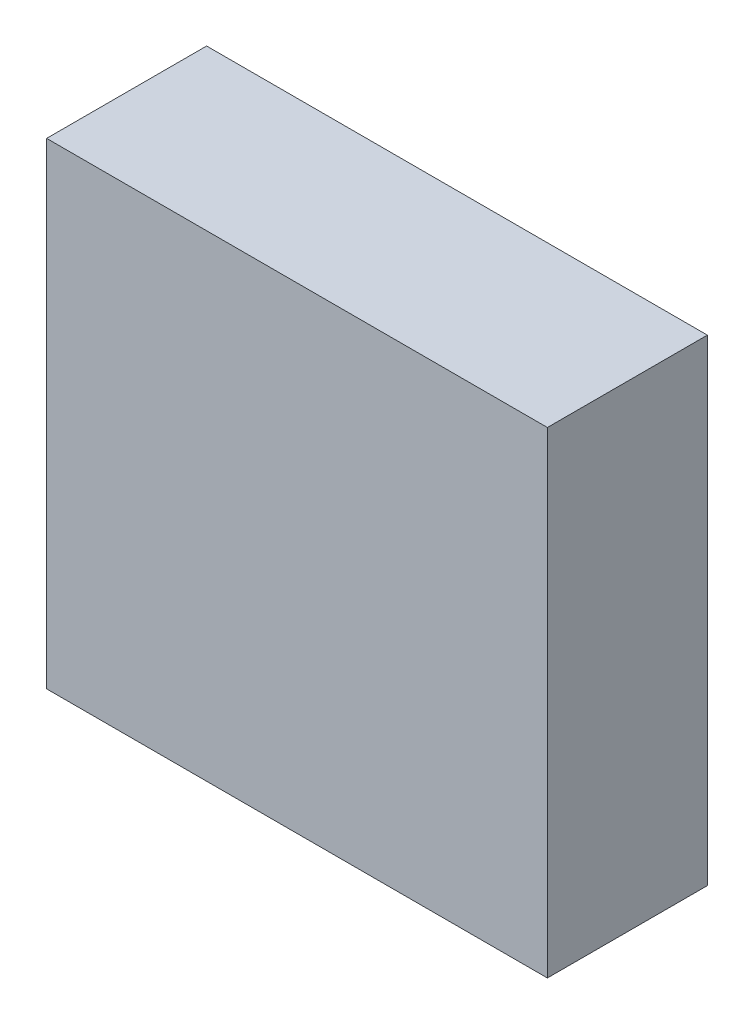
ISO-10303-21;
HEADER;
FILE_DESCRIPTION(('STEP AP214'),'2;1');
FILE_NAME('part.step','',(''),(''),'','','');
FILE_SCHEMA(('AUTOMOTIVE_DESIGN { 1 0 10303 214 1 1 1 1 }'));
ENDSEC;
DATA;
#1=APPLICATION_CONTEXT('core data for automotive mechanical design processes');
#2=APPLICATION_PROTOCOL_DEFINITION('international standard','automotive_design',2000,#1);
#3=PRODUCT_CONTEXT('',#1,'mechanical');
#4=PRODUCT('Part','Part','',(#3));
#5=PRODUCT_RELATED_PRODUCT_CATEGORY('part','',(#4));
#6=PRODUCT_DEFINITION_FORMATION('','',#4);
#7=PRODUCT_DEFINITION_CONTEXT('part definition',#1,'design');
#8=PRODUCT_DEFINITION('design','',#6,#7);
#9=PRODUCT_DEFINITION_SHAPE('','',#8);
#10=(LENGTH_UNIT() NAMED_UNIT(*) SI_UNIT(.MILLI.,.METRE.));
#11=(NAMED_UNIT(*) PLANE_ANGLE_UNIT() SI_UNIT($,.RADIAN.));
#12=(NAMED_UNIT(*) SI_UNIT($,.STERADIAN.) SOLID_ANGLE_UNIT());
#13=UNCERTAINTY_MEASURE_WITH_UNIT(LENGTH_MEASURE(1.E-05),#10,'distance_accuracy_value','');
#14=(GEOMETRIC_REPRESENTATION_CONTEXT(3) GLOBAL_UNCERTAINTY_ASSIGNED_CONTEXT((#13)) GLOBAL_UNIT_ASSIGNED_CONTEXT((#10,
#11,#12)) REPRESENTATION_CONTEXT('',''));
#15=CARTESIAN_POINT('',(0.,0.,0.));
#16=DIRECTION('',(0.,0.,1.));
#17=DIRECTION('',(1.,0.,0.));
#18=AXIS2_PLACEMENT_3D('',#15,#16,#17);
#19=CARTESIAN_POINT('',(39.751,37.846,25.4));
#20=DIRECTION('',(-1.,0.,0.));
#21=DIRECTION('',(0.,-1.,0.));
#22=AXIS2_PLACEMENT_3D('',#19,#20,#21);
#23=PLANE('',#22);
#24=DIRECTION('',(0.,1.,0.));
#25=VECTOR('',#24,1.);
#26=CARTESIAN_POINT('',(39.751,37.846,0.));
#27=LINE('',#26,#25);
#28=CARTESIAN_POINT('',(39.751,-37.846,0.));
#29=VERTEX_POINT('',#28);
#30=CARTESIAN_POINT('',(39.751,37.846,0.));
#31=VERTEX_POINT('',#30);
#32=EDGE_CURVE('E106',#29,#31,#27,.T.);
#33=ORIENTED_EDGE('',*,*,#32,.T.);
#34=DIRECTION('',(0.,0.,-1.));
#35=VECTOR('',#34,1.);
#36=CARTESIAN_POINT('',(39.751,37.846,25.4));
#37=LINE('',#36,#35);
#38=CARTESIAN_POINT('',(39.751,37.846,25.4));
#39=VERTEX_POINT('',#38);
#40=EDGE_CURVE('E11',#39,#31,#37,.T.);
#41=ORIENTED_EDGE('',*,*,#40,.F.);
#42=DIRECTION('',(0.,1.,0.));
#43=VECTOR('',#42,1.);
#44=CARTESIAN_POINT('',(39.751,37.846,25.4));
#45=LINE('',#44,#43);
#46=CARTESIAN_POINT('',(39.751,-37.846,25.4));
#47=VERTEX_POINT('',#46);
#48=EDGE_CURVE('E94',#47,#39,#45,.T.);
#49=ORIENTED_EDGE('',*,*,#48,.F.);
#50=DIRECTION('',(0.,0.,-1.));
#51=VECTOR('',#50,1.);
#52=CARTESIAN_POINT('',(39.751,-37.846,25.4));
#53=LINE('',#52,#51);
#54=EDGE_CURVE('E102',#47,#29,#53,.T.);
#55=ORIENTED_EDGE('',*,*,#54,.T.);
#56=EDGE_LOOP('',(#33,#41,#49,#55));
#57=FACE_BOUND('',#56,.T.);
#58=ADVANCED_FACE('F43',(#57),#23,.F.);
#59=CARTESIAN_POINT('',(-39.751,37.846,25.4));
#60=DIRECTION('',(0.,-1.,0.));
#61=DIRECTION('',(0.,0.,-1.));
#62=AXIS2_PLACEMENT_3D('',#59,#60,#61);
#63=PLANE('',#62);
#64=DIRECTION('',(-1.,0.,0.));
#65=VECTOR('',#64,1.);
#66=CARTESIAN_POINT('',(-39.751,37.846,0.));
#67=LINE('',#66,#65);
#68=CARTESIAN_POINT('',(-39.751,37.846,0.));
#69=VERTEX_POINT('',#68);
#70=EDGE_CURVE('E98',#31,#69,#67,.T.);
#71=ORIENTED_EDGE('',*,*,#70,.T.);
#72=DIRECTION('',(0.,0.,-1.));
#73=VECTOR('',#72,1.);
#74=CARTESIAN_POINT('',(-39.751,37.846,25.4));
#75=LINE('',#74,#73);
#76=CARTESIAN_POINT('',(-39.751,37.846,25.4));
#77=VERTEX_POINT('',#76);
#78=EDGE_CURVE('E51',#77,#69,#75,.T.);
#79=ORIENTED_EDGE('',*,*,#78,.F.);
#80=DIRECTION('',(-1.,0.,0.));
#81=VECTOR('',#80,1.);
#82=CARTESIAN_POINT('',(-39.751,37.846,25.4));
#83=LINE('',#82,#81);
#84=EDGE_CURVE('E89',#39,#77,#83,.T.);
#85=ORIENTED_EDGE('',*,*,#84,.F.);
#86=ORIENTED_EDGE('',*,*,#40,.T.);
#87=EDGE_LOOP('',(#71,#79,#85,#86));
#88=FACE_BOUND('',#87,.T.);
#89=ADVANCED_FACE('F97',(#88),#63,.F.);
#90=CARTESIAN_POINT('',(-39.751,37.846,25.4));
#91=DIRECTION('',(1.,0.,0.));
#92=DIRECTION('',(0.,1.,0.));
#93=AXIS2_PLACEMENT_3D('',#90,#91,#92);
#94=PLANE('',#93);
#95=DIRECTION('',(0.,-1.,0.));
#96=VECTOR('',#95,1.);
#97=CARTESIAN_POINT('',(-39.751,37.846,0.));
#98=LINE('',#97,#96);
#99=CARTESIAN_POINT('',(-39.751,-37.846,0.));
#100=VERTEX_POINT('',#99);
#101=EDGE_CURVE('E76',#69,#100,#98,.T.);
#102=ORIENTED_EDGE('',*,*,#101,.T.);
#103=DIRECTION('',(0.,0.,-1.));
#104=VECTOR('',#103,1.);
#105=CARTESIAN_POINT('',(-39.751,-37.846,25.4));
#106=LINE('',#105,#104);
#107=CARTESIAN_POINT('',(-39.751,-37.846,25.4));
#108=VERTEX_POINT('',#107);
#109=EDGE_CURVE('E99',#108,#100,#106,.T.);
#110=ORIENTED_EDGE('',*,*,#109,.F.);
#111=DIRECTION('',(0.,-1.,0.));
#112=VECTOR('',#111,1.);
#113=CARTESIAN_POINT('',(-39.751,37.846,25.4));
#114=LINE('',#113,#112);
#115=EDGE_CURVE('E92',#77,#108,#114,.T.);
#116=ORIENTED_EDGE('',*,*,#115,.F.);
#117=ORIENTED_EDGE('',*,*,#78,.T.);
#118=EDGE_LOOP('',(#102,#110,#116,#117));
#119=FACE_BOUND('',#118,.T.);
#120=ADVANCED_FACE('F100',(#119),#94,.F.);
#121=CARTESIAN_POINT('',(-39.751,-37.846,25.4));
#122=DIRECTION('',(0.,1.,0.));
#123=DIRECTION('',(0.,0.,1.));
#124=AXIS2_PLACEMENT_3D('',#121,#122,#123);
#125=PLANE('',#124);
#126=DIRECTION('',(1.,0.,0.));
#127=VECTOR('',#126,1.);
#128=CARTESIAN_POINT('',(-39.751,-37.846,0.));
#129=LINE('',#128,#127);
#130=EDGE_CURVE('E82',#100,#29,#129,.T.);
#131=ORIENTED_EDGE('',*,*,#130,.T.);
#132=ORIENTED_EDGE('',*,*,#54,.F.);
#133=DIRECTION('',(1.,0.,0.));
#134=VECTOR('',#133,1.);
#135=CARTESIAN_POINT('',(-39.751,-37.846,25.4));
#136=LINE('',#135,#134);
#137=EDGE_CURVE('E59',#108,#47,#136,.T.);
#138=ORIENTED_EDGE('',*,*,#137,.F.);
#139=ORIENTED_EDGE('',*,*,#109,.T.);
#140=EDGE_LOOP('',(#131,#132,#138,#139));
#141=FACE_BOUND('',#140,.T.);
#142=ADVANCED_FACE('F113',(#141),#125,.F.);
#143=CARTESIAN_POINT('',(0.,0.,25.4));
#144=DIRECTION('',(0.,0.,1.));
#145=DIRECTION('',(1.,0.,0.));
#146=AXIS2_PLACEMENT_3D('',#143,#144,#145);
#147=PLANE('',#146);
#148=ORIENTED_EDGE('',*,*,#48,.T.);
#149=ORIENTED_EDGE('',*,*,#84,.T.);
#150=ORIENTED_EDGE('',*,*,#115,.T.);
#151=ORIENTED_EDGE('',*,*,#137,.T.);
#152=EDGE_LOOP('',(#148,#149,#150,#151));
#153=FACE_BOUND('',#152,.T.);
#154=ADVANCED_FACE('F90',(#153),#147,.T.);
#155=CARTESIAN_POINT('',(0.,0.,0.));
#156=DIRECTION('',(0.,0.,1.));
#157=DIRECTION('',(1.,0.,0.));
#158=AXIS2_PLACEMENT_3D('',#155,#156,#157);
#159=PLANE('',#158);
#160=ORIENTED_EDGE('',*,*,#32,.F.);
#161=ORIENTED_EDGE('',*,*,#130,.F.);
#162=ORIENTED_EDGE('',*,*,#101,.F.);
#163=ORIENTED_EDGE('',*,*,#70,.F.);
#164=EDGE_LOOP('',(#160,#161,#162,#163));
#165=FACE_BOUND('',#164,.T.);
#166=ADVANCED_FACE('F116',(#165),#159,.F.);
#167=CLOSED_SHELL('',(#58,#89,#120,#142,#154,#166));
#168=MANIFOLD_SOLID_BREP('B2',#167);
#169=ADVANCED_BREP_SHAPE_REPRESENTATION('',(#18,#168),#14);
#170=SHAPE_DEFINITION_REPRESENTATION(#9,#169);
ENDSEC;
END-ISO-10303-21;
